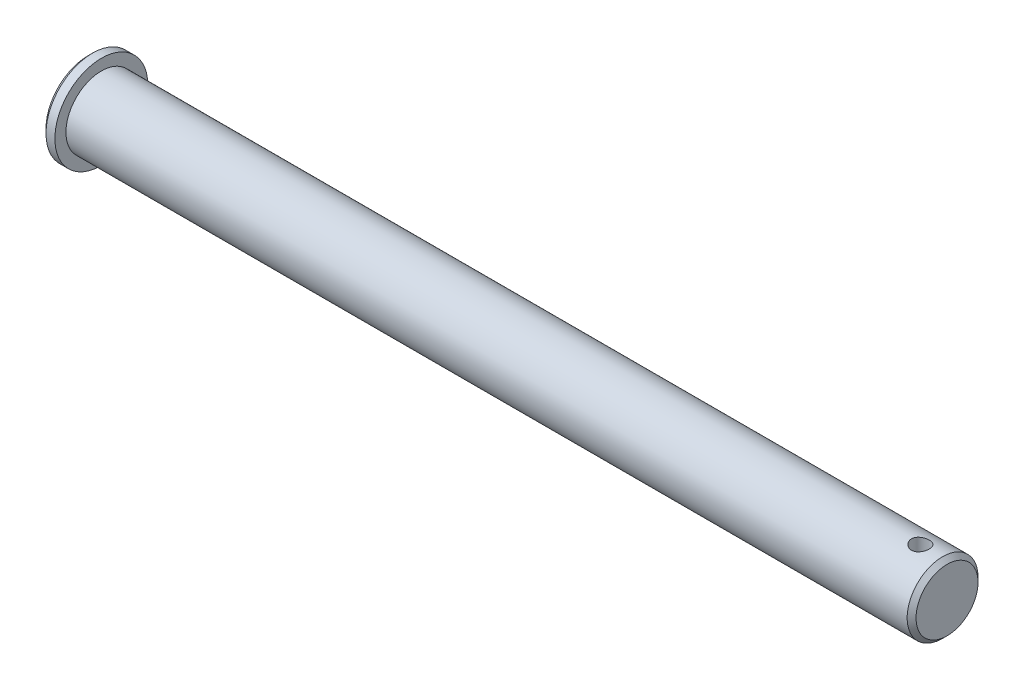
ISO-10303-21;
HEADER;
FILE_DESCRIPTION(('STEP AP214'),'2;1');
FILE_NAME('part.step','',(''),(''),'','','');
FILE_SCHEMA(('AUTOMOTIVE_DESIGN { 1 0 10303 214 1 1 1 1 }'));
ENDSEC;
DATA;
#1=APPLICATION_CONTEXT('core data for automotive mechanical design processes');
#2=APPLICATION_PROTOCOL_DEFINITION('international standard','automotive_design',2000,#1);
#3=PRODUCT_CONTEXT('',#1,'mechanical');
#4=PRODUCT('Part','Part','',(#3));
#5=PRODUCT_RELATED_PRODUCT_CATEGORY('part','',(#4));
#6=PRODUCT_DEFINITION_FORMATION('','',#4);
#7=PRODUCT_DEFINITION_CONTEXT('part definition',#1,'design');
#8=PRODUCT_DEFINITION('design','',#6,#7);
#9=PRODUCT_DEFINITION_SHAPE('','',#8);
#10=(LENGTH_UNIT() NAMED_UNIT(*) SI_UNIT(.MILLI.,.METRE.));
#11=(NAMED_UNIT(*) PLANE_ANGLE_UNIT() SI_UNIT($,.RADIAN.));
#12=(NAMED_UNIT(*) SI_UNIT($,.STERADIAN.) SOLID_ANGLE_UNIT());
#13=UNCERTAINTY_MEASURE_WITH_UNIT(LENGTH_MEASURE(1.E-05),#10,'distance_accuracy_value','');
#14=(GEOMETRIC_REPRESENTATION_CONTEXT(3) GLOBAL_UNCERTAINTY_ASSIGNED_CONTEXT((#13)) GLOBAL_UNIT_ASSIGNED_CONTEXT((#10,
#11,#12)) REPRESENTATION_CONTEXT('',''));
#15=CARTESIAN_POINT('',(0.,0.,0.));
#16=DIRECTION('',(0.,0.,1.));
#17=DIRECTION('',(1.,0.,0.));
#18=AXIS2_PLACEMENT_3D('',#15,#16,#17);
#19=CARTESIAN_POINT('',(0.,0.,0.));
#20=DIRECTION('',(-1.,0.,0.));
#21=DIRECTION('',(0.,0.,1.));
#22=AXIS2_PLACEMENT_3D('',#19,#20,#21);
#23=PLANE('',#22);
#24=CARTESIAN_POINT('',(0.,0.,0.));
#25=DIRECTION('',(-1.,0.,0.));
#26=DIRECTION('',(0.,0.,1.));
#27=AXIS2_PLACEMENT_3D('',#24,#25,#26);
#28=CIRCLE('',#27,9.49999999999998);
#29=CARTESIAN_POINT('',(0.,0.,9.49999999999998));
#30=VERTEX_POINT('',#29);
#31=EDGE_CURVE('E10',#30,#30,#28,.T.);
#32=ORIENTED_EDGE('',*,*,#31,.T.);
#33=EDGE_LOOP('',(#32));
#34=FACE_BOUND('',#33,.T.);
#35=ADVANCED_FACE('F39',(#34),#23,.T.);
#36=CARTESIAN_POINT('',(194.,0.,0.));
#37=DIRECTION('',(1.,0.,0.));
#38=DIRECTION('',(0.,0.,-1.));
#39=AXIS2_PLACEMENT_3D('',#36,#37,#38);
#40=CYLINDRICAL_SURFACE('',#39,10.5);
#41=CARTESIAN_POINT('',(1.,0.,0.));
#42=DIRECTION('',(-1.,0.,0.));
#43=DIRECTION('',(0.,0.,1.));
#44=AXIS2_PLACEMENT_3D('',#41,#42,#43);
#45=CIRCLE('',#44,10.5);
#46=CARTESIAN_POINT('',(1.,0.,10.5));
#47=VERTEX_POINT('',#46);
#48=EDGE_CURVE('E48',#47,#47,#45,.F.);
#49=ORIENTED_EDGE('',*,*,#48,.T.);
#50=EDGE_LOOP('',(#49));
#51=FACE_BOUND('',#50,.T.);
#52=CARTESIAN_POINT('',(3.,0.,0.));
#53=DIRECTION('',(1.,0.,0.));
#54=DIRECTION('',(0.,0.,-1.));
#55=AXIS2_PLACEMENT_3D('',#52,#53,#54);
#56=CIRCLE('',#55,10.5);
#57=CARTESIAN_POINT('',(3.,0.,-10.5));
#58=VERTEX_POINT('',#57);
#59=EDGE_CURVE('E64',#58,#58,#56,.T.);
#60=ORIENTED_EDGE('',*,*,#59,.F.);
#61=EDGE_LOOP('',(#60));
#62=FACE_BOUND('',#61,.T.);
#63=ADVANCED_FACE('F99',(#51,#62),#40,.T.);
#64=CARTESIAN_POINT('',(3.,10.5,0.));
#65=DIRECTION('',(1.,0.,0.));
#66=DIRECTION('',(0.,0.,-1.));
#67=AXIS2_PLACEMENT_3D('',#64,#65,#66);
#68=PLANE('',#67);
#69=ORIENTED_EDGE('',*,*,#59,.T.);
#70=EDGE_LOOP('',(#69));
#71=FACE_BOUND('',#70,.T.);
#72=CARTESIAN_POINT('',(3.,0.,0.));
#73=DIRECTION('',(1.,0.,0.));
#74=DIRECTION('',(0.,0.,-1.));
#75=AXIS2_PLACEMENT_3D('',#72,#73,#74);
#76=CIRCLE('',#75,8.);
#77=CARTESIAN_POINT('',(3.,0.,-8.));
#78=VERTEX_POINT('',#77);
#79=EDGE_CURVE('E74',#78,#78,#76,.T.);
#80=ORIENTED_EDGE('',*,*,#79,.F.);
#81=EDGE_LOOP('',(#80));
#82=FACE_BOUND('',#81,.T.);
#83=ADVANCED_FACE('F96',(#71,#82),#68,.T.);
#84=CARTESIAN_POINT('',(194.,0.,0.));
#85=DIRECTION('',(1.,0.,0.));
#86=DIRECTION('',(0.,0.,-1.));
#87=AXIS2_PLACEMENT_3D('',#84,#85,#86);
#88=CYLINDRICAL_SURFACE('',#87,8.);
#89=CARTESIAN_POINT('',(193.,0.,0.));
#90=DIRECTION('',(1.,0.,0.));
#91=DIRECTION('',(0.,0.,-1.));
#92=AXIS2_PLACEMENT_3D('',#89,#90,#91);
#93=CIRCLE('',#92,8.);
#94=CARTESIAN_POINT('',(193.,0.,-8.));
#95=VERTEX_POINT('',#94);
#96=EDGE_CURVE('E53',#95,#95,#93,.F.);
#97=ORIENTED_EDGE('',*,*,#96,.T.);
#98=EDGE_LOOP('',(#97));
#99=FACE_BOUND('',#98,.T.);
#100=CARTESIAN_POINT('',(188.,-7.74596669241484,2.));
#101=CARTESIAN_POINT('',(187.889559399259,-7.74596880070288,1.99999686287445));
#102=CARTESIAN_POINT('',(187.779084081057,-7.74835444811678,1.99082099639812));
#103=CARTESIAN_POINT('',(187.561305937461,-7.75761489594051,1.95441850037103));
#104=CARTESIAN_POINT('',(187.454004996425,-7.76449230897304,1.92718136539368));
#105=CARTESIAN_POINT('',(187.24575716945,-7.7819097967692,1.85559295970562));
#106=CARTESIAN_POINT('',(187.144802275691,-7.79244514152367,1.81126378228358));
#107=CARTESIAN_POINT('',(186.951751317968,-7.81598553623007,1.70681691300909));
#108=CARTESIAN_POINT('',(186.859655630336,-7.82899069102792,1.64669855084853));
#109=CARTESIAN_POINT('',(186.68491068379,-7.856325730845,1.51096674184949));
#110=CARTESIAN_POINT('',(186.60248511972,-7.87067678098428,1.43506951016323));
#111=CARTESIAN_POINT('',(186.451390884512,-7.89890300412235,1.27054565128053));
#112=CARTESIAN_POINT('',(186.382723499503,-7.91277813253111,1.18191783534425));
#113=CARTESIAN_POINT('',(186.260179625895,-7.93872332416466,0.992916160863166));
#114=CARTESIAN_POINT('',(186.206522889471,-7.95076549920474,0.892395660956097));
#115=CARTESIAN_POINT('',(186.116952284678,-7.97144649540787,0.683410547434204));
#116=CARTESIAN_POINT('',(186.081035798468,-7.98008581867476,0.57494710863354));
#117=CARTESIAN_POINT('',(186.028681732337,-7.99283807078544,0.355487007003313));
#118=CARTESIAN_POINT('',(186.011864284539,-7.99703915075451,0.244586175639166));
#119=CARTESIAN_POINT('',(185.99699329658,-8.00074875285838,0.0214630554102057));
#120=CARTESIAN_POINT('',(185.998936982232,-8.00025796877363,-0.0907590356304624));
#121=CARTESIAN_POINT('',(186.0212598802,-7.99470475962828,-0.310704494344781));
#122=CARTESIAN_POINT('',(186.041229060043,-7.98974401872699,-0.418472431202141));
#123=CARTESIAN_POINT('',(186.098377016039,-7.97592669219883,-0.629076494827379));
#124=CARTESIAN_POINT('',(186.135556708302,-7.96706989918753,-0.731912358740882));
#125=CARTESIAN_POINT('',(186.22640205655,-7.94630007760716,-0.930813407003617));
#126=CARTESIAN_POINT('',(186.280213635729,-7.93436015756043,-1.02680901953301));
#127=CARTESIAN_POINT('',(186.402684543293,-7.90871923047719,-1.20855124468098));
#128=CARTESIAN_POINT('',(186.471346454849,-7.89501791721992,-1.29429607017101));
#129=CARTESIAN_POINT('',(186.623766993586,-7.86690971015616,-1.45554807016992));
#130=CARTESIAN_POINT('',(186.707883913878,-7.85249375620734,-1.53071535815041));
#131=CARTESIAN_POINT('',(186.887679978832,-7.82492034813365,-1.66595275192605));
#132=CARTESIAN_POINT('',(186.983359663593,-7.81176295284776,-1.72602215209204));
#133=CARTESIAN_POINT('',(187.184232027319,-7.78816397465319,-1.8295762580452));
#134=CARTESIAN_POINT('',(187.289468584251,-7.77773586980576,-1.87297913394099));
#135=CARTESIAN_POINT('',(187.506068374461,-7.76094912111965,-1.94137124127269));
#136=CARTESIAN_POINT('',(187.617430291187,-7.75458960648175,-1.96636441310582));
#137=CARTESIAN_POINT('',(187.839967601219,-7.74684284831313,-1.99666371093214));
#138=CARTESIAN_POINT('',(187.951070234664,-7.74532871274919,-2.0024723791357));
#139=CARTESIAN_POINT('',(188.172657549263,-7.74709874784832,-1.99561359241243));
#140=CARTESIAN_POINT('',(188.283142286361,-7.75038247681013,-1.98294783827903));
#141=CARTESIAN_POINT('',(188.498491411964,-7.76125665563649,-1.93994037115012));
#142=CARTESIAN_POINT('',(188.603418181257,-7.768775761875,-1.90989125462539));
#143=CARTESIAN_POINT('',(188.806745166281,-7.7872057461677,-1.83329446533649));
#144=CARTESIAN_POINT('',(188.905144607244,-7.79811702598891,-1.78674483817003));
#145=CARTESIAN_POINT('',(189.094753022294,-7.8223690967461,-1.67741653434924));
#146=CARTESIAN_POINT('',(189.185783072034,-7.83575334885313,-1.6143374030685));
#147=CARTESIAN_POINT('',(189.356150690241,-7.86333666457373,-1.47412058586891));
#148=CARTESIAN_POINT('',(189.43548633332,-7.87753586182776,-1.39698058961088));
#149=CARTESIAN_POINT('',(189.582248834057,-7.90557922425285,-1.22852544196945));
#150=CARTESIAN_POINT('',(189.649328050039,-7.91940561649468,-1.13690390506318));
#151=CARTESIAN_POINT('',(189.767148693561,-7.94477773290988,-0.943405365389345));
#152=CARTESIAN_POINT('',(189.817890973287,-7.95632357603169,-0.84152889791518));
#153=CARTESIAN_POINT('',(189.901156827622,-7.9757609259065,-0.631116403462181));
#154=CARTESIAN_POINT('',(189.933811427503,-7.98367864017925,-0.522634762055761));
#155=CARTESIAN_POINT('',(189.980368267687,-7.99508234716634,-0.301499520637607));
#156=CARTESIAN_POINT('',(189.994274126991,-7.99856919514738,-0.188846730082473));
#157=CARTESIAN_POINT('',(190.002735179151,-8.00068338817612,0.0341670528866546));
#158=CARTESIAN_POINT('',(189.997803418191,-7.99943957759977,0.144507653932052));
#159=CARTESIAN_POINT('',(189.969904345411,-7.99251792914887,0.36273499282951));
#160=CARTESIAN_POINT('',(189.946937569974,-7.98684022314338,0.470621803561865));
#161=CARTESIAN_POINT('',(189.883895560458,-7.97170865707778,0.680342071289556));
#162=CARTESIAN_POINT('',(189.843913093371,-7.96227529004785,0.782204989161734));
#163=CARTESIAN_POINT('',(189.748058841961,-7.94062577827316,0.977834106083256));
#164=CARTESIAN_POINT('',(189.692185054659,-7.92840928277515,1.07159928253127));
#165=CARTESIAN_POINT('',(189.564569532008,-7.90214499360574,1.25080385684661));
#166=CARTESIAN_POINT('',(189.492479714192,-7.88806033883329,1.33598997659667));
#167=CARTESIAN_POINT('',(189.335154296045,-7.85981298114379,1.49323004054701));
#168=CARTESIAN_POINT('',(189.249915367778,-7.84565025934605,1.56528065015318));
#169=CARTESIAN_POINT('',(189.066797171621,-7.81854951691005,1.69552405294366));
#170=CARTESIAN_POINT('',(188.968711753269,-7.80563927346578,1.75343323883276));
#171=CARTESIAN_POINT('',(188.76388902025,-7.78287910989656,1.85185379317094));
#172=CARTESIAN_POINT('',(188.657158067812,-7.77302696466428,1.8923778195043));
#173=CARTESIAN_POINT('',(188.45884597633,-7.75903817501475,1.948845057142));
#174=CARTESIAN_POINT('',(188.368213671228,-7.75417326006998,1.96798634119375));
#175=CARTESIAN_POINT('',(188.185062262005,-7.7476367716524,1.99356458514353));
#176=CARTESIAN_POINT('',(188.092543319511,-7.74596492578216,2.0000026287435));
#177=CARTESIAN_POINT('',(188.,-7.74596669241484,2.));
#178=B_SPLINE_CURVE_WITH_KNOTS('',3,(#100,#101,#102,#103,#104,#105,#106,#107,#108,#109,#110,
#111,#112,#113,#114,#115,#116,#117,#118,#119,#120,#121,#122,#123,#124,#125,#126,#127,#128,#129,
#130,#131,#132,#133,#134,#135,#136,#137,#138,#139,#140,#141,#142,#143,#144,#145,#146,#147,#148,
#149,#150,#151,#152,#153,#154,#155,#156,#157,#158,#159,#160,#161,#162,#163,#164,#165,#166,#167,
#168,#169,#170,#171,#172,#173,#174,#175,#176,#177),.UNSPECIFIED.,.T.,.F.,(4,2,2,2,2,2,2,2,2,2,2,
2,2,2,2,2,2,2,2,2,2,2,2,2,2,2,2,2,2,2,2,2,2,2,2,2,2,2,4),(0.,0.330981953388902,
0.662156593142942,0.992904581732849,1.32366661404385,1.66099163354379,1.99834817183892,
2.34041197118334,2.68242527877675,3.01751000796277,3.35254518932816,3.68014610151157,
4.00776445379829,4.33834299403553,4.66897908375129,5.00856373257529,5.34816424959842,
5.68941145606725,6.03058560103639,6.36274859809374,6.69488101747042,7.02157924007366,
7.34831617137131,7.68146276687324,8.01466415108033,8.35620264772252,8.69772332575639,
9.03673658245541,9.37568439127228,9.70546756901963,10.0352409390158,10.3632390124777,
10.6912784459046,11.0271767726565,11.363160252524,11.7054118182895,12.0474137709605,
12.3247826174462,12.6021278008237),.UNSPECIFIED.);
#179=CARTESIAN_POINT('',(188.,-7.74596669241484,2.));
#180=VERTEX_POINT('',#179);
#181=EDGE_CURVE('E65',#180,#180,#178,.T.);
#182=ORIENTED_EDGE('',*,*,#181,.F.);
#183=EDGE_LOOP('',(#182));
#184=FACE_BOUND('',#183,.T.);
#185=CARTESIAN_POINT('',(188.,7.74596669241483,2.));
#186=CARTESIAN_POINT('',(188.110440600741,7.74596880070288,1.99999686287445));
#187=CARTESIAN_POINT('',(188.220915918943,7.74835444811678,1.99082099639812));
#188=CARTESIAN_POINT('',(188.438694062539,7.75761489594051,1.95441850037103));
#189=CARTESIAN_POINT('',(188.545995003575,7.76449230897304,1.92718136539368));
#190=CARTESIAN_POINT('',(188.75424283055,7.7819097967692,1.85559295970562));
#191=CARTESIAN_POINT('',(188.855197724309,7.79244514152366,1.81126378228358));
#192=CARTESIAN_POINT('',(189.048248682032,7.81598553623007,1.7068169130091));
#193=CARTESIAN_POINT('',(189.140344369664,7.82899069102792,1.64669855084854));
#194=CARTESIAN_POINT('',(189.31508931621,7.856325730845,1.51096674184949));
#195=CARTESIAN_POINT('',(189.39751488028,7.87067678098428,1.43506951016323));
#196=CARTESIAN_POINT('',(189.548609115488,7.89890300412235,1.27054565128053));
#197=CARTESIAN_POINT('',(189.617276500497,7.91277813253111,1.18191783534424));
#198=CARTESIAN_POINT('',(189.739820374105,7.93872332416466,0.992916160863163));
#199=CARTESIAN_POINT('',(189.793477110529,7.95076549920474,0.892395660956094));
#200=CARTESIAN_POINT('',(189.883047715322,7.97144649540787,0.6834105474342));
#201=CARTESIAN_POINT('',(189.918964201532,7.98008581867476,0.574947108633536));
#202=CARTESIAN_POINT('',(189.971318267663,7.99283807078544,0.355487007003311));
#203=CARTESIAN_POINT('',(189.988135715461,7.99703915075451,0.244586175639166));
#204=CARTESIAN_POINT('',(190.00300670342,8.00074875285838,0.0214630554102064));
#205=CARTESIAN_POINT('',(190.001063017768,8.00025796877363,-0.0907590356304621));
#206=CARTESIAN_POINT('',(189.9787401198,7.99470475962828,-0.310704494344781));
#207=CARTESIAN_POINT('',(189.958770939957,7.98974401872699,-0.418472431202141));
#208=CARTESIAN_POINT('',(189.901622983961,7.97592669219883,-0.629076494827379));
#209=CARTESIAN_POINT('',(189.864443291698,7.96706989918753,-0.731912358740883));
#210=CARTESIAN_POINT('',(189.77359794345,7.94630007760716,-0.930813407003617));
#211=CARTESIAN_POINT('',(189.719786364271,7.93436015756043,-1.02680901953301));
#212=CARTESIAN_POINT('',(189.597315456707,7.90871923047719,-1.20855124468098));
#213=CARTESIAN_POINT('',(189.528653545151,7.89501791721992,-1.29429607017101));
#214=CARTESIAN_POINT('',(189.376233006414,7.86690971015616,-1.45554807016992));
#215=CARTESIAN_POINT('',(189.292116086122,7.85249375620734,-1.53071535815041));
#216=CARTESIAN_POINT('',(189.112320021168,7.82492034813365,-1.66595275192605));
#217=CARTESIAN_POINT('',(189.016640336407,7.81176295284776,-1.72602215209204));
#218=CARTESIAN_POINT('',(188.815767972681,7.78816397465319,-1.8295762580452));
#219=CARTESIAN_POINT('',(188.710531415749,7.77773586980577,-1.87297913394098));
#220=CARTESIAN_POINT('',(188.493931625539,7.76094912111965,-1.94137124127268));
#221=CARTESIAN_POINT('',(188.382569708813,7.75458960648175,-1.96636441310582));
#222=CARTESIAN_POINT('',(188.160032398781,7.74684284831313,-1.99666371093214));
#223=CARTESIAN_POINT('',(188.048929765336,7.74532871274919,-2.0024723791357));
#224=CARTESIAN_POINT('',(187.827342450737,7.74709874784832,-1.99561359241243));
#225=CARTESIAN_POINT('',(187.716857713639,7.75038247681013,-1.98294783827903));
#226=CARTESIAN_POINT('',(187.501508588036,7.76125665563649,-1.93994037115012));
#227=CARTESIAN_POINT('',(187.396581818743,7.768775761875,-1.90989125462539));
#228=CARTESIAN_POINT('',(187.193254833719,7.7872057461677,-1.83329446533649));
#229=CARTESIAN_POINT('',(187.094855392756,7.79811702598891,-1.78674483817003));
#230=CARTESIAN_POINT('',(186.905246977706,7.8223690967461,-1.67741653434924));
#231=CARTESIAN_POINT('',(186.814216927966,7.83575334885313,-1.6143374030685));
#232=CARTESIAN_POINT('',(186.643849309759,7.86333666457373,-1.47412058586891));
#233=CARTESIAN_POINT('',(186.56451366668,7.87753586182776,-1.39698058961088));
#234=CARTESIAN_POINT('',(186.417751165943,7.90557922425285,-1.22852544196945));
#235=CARTESIAN_POINT('',(186.350671949961,7.91940561649468,-1.13690390506319));
#236=CARTESIAN_POINT('',(186.232851306439,7.94477773290988,-0.943405365389355));
#237=CARTESIAN_POINT('',(186.182109026713,7.95632357603169,-0.841528897915185));
#238=CARTESIAN_POINT('',(186.098843172378,7.9757609259065,-0.63111640346218));
#239=CARTESIAN_POINT('',(186.066188572497,7.98367864017925,-0.522634762055761));
#240=CARTESIAN_POINT('',(186.019631732313,7.99508234716634,-0.301499520637607));
#241=CARTESIAN_POINT('',(186.005725873009,7.99856919514738,-0.188846730082474));
#242=CARTESIAN_POINT('',(185.997264820849,8.00068338817612,0.0341670528866544));
#243=CARTESIAN_POINT('',(186.002196581809,7.99943957759977,0.144507653932052));
#244=CARTESIAN_POINT('',(186.030095654589,7.99251792914887,0.36273499282951));
#245=CARTESIAN_POINT('',(186.053062430026,7.98684022314338,0.470621803561866));
#246=CARTESIAN_POINT('',(186.116104439542,7.97170865707778,0.680342071289556));
#247=CARTESIAN_POINT('',(186.156086906629,7.96227529004785,0.782204989161734));
#248=CARTESIAN_POINT('',(186.251941158039,7.94062577827316,0.977834106083256));
#249=CARTESIAN_POINT('',(186.307814945341,7.92840928277515,1.07159928253127));
#250=CARTESIAN_POINT('',(186.435430467992,7.90214499360574,1.25080385684661));
#251=CARTESIAN_POINT('',(186.507520285808,7.88806033883329,1.33598997659667));
#252=CARTESIAN_POINT('',(186.664845703955,7.85981298114379,1.49323004054701));
#253=CARTESIAN_POINT('',(186.750084632222,7.84565025934604,1.56528065015318));
#254=CARTESIAN_POINT('',(186.933202828379,7.81854951691005,1.69552405294366));
#255=CARTESIAN_POINT('',(187.031288246731,7.80563927346578,1.75343323883275));
#256=CARTESIAN_POINT('',(187.23611097975,7.78287910989656,1.85185379317093));
#257=CARTESIAN_POINT('',(187.342841932188,7.77302696466428,1.8923778195043));
#258=CARTESIAN_POINT('',(187.54115402367,7.75903817501475,1.948845057142));
#259=CARTESIAN_POINT('',(187.631786328772,7.75417326006998,1.96798634119375));
#260=CARTESIAN_POINT('',(187.814937737995,7.7476367716524,1.99356458514353));
#261=CARTESIAN_POINT('',(187.907456680489,7.74596492578215,2.0000026287435));
#262=CARTESIAN_POINT('',(188.,7.74596669241483,2.));
#263=B_SPLINE_CURVE_WITH_KNOTS('',3,(#185,#186,#187,#188,#189,#190,#191,#192,#193,#194,#195,
#196,#197,#198,#199,#200,#201,#202,#203,#204,#205,#206,#207,#208,#209,#210,#211,#212,#213,#214,
#215,#216,#217,#218,#219,#220,#221,#222,#223,#224,#225,#226,#227,#228,#229,#230,#231,#232,#233,
#234,#235,#236,#237,#238,#239,#240,#241,#242,#243,#244,#245,#246,#247,#248,#249,#250,#251,#252,
#253,#254,#255,#256,#257,#258,#259,#260,#261,#262),.UNSPECIFIED.,.T.,.F.,(4,2,2,2,2,2,2,2,2,2,2,
2,2,2,2,2,2,2,2,2,2,2,2,2,2,2,2,2,2,2,2,2,2,2,2,2,2,2,4),(0.,0.330981953388903,
0.662156593142942,0.992904581732819,1.32366661404385,1.66099163354379,1.99834817183892,
2.34041197118337,2.68242527877675,3.01751000796277,3.35254518932816,3.68014610151158,
4.00776445379829,4.33834299403554,4.66897908375129,5.0085637325753,5.34816424959842,
5.68941145606722,6.0305856010364,6.36274859809374,6.69488101747042,7.02157924007363,
7.34831617137131,7.68146276687324,8.01466415108034,8.35620264772252,8.6977233257564,
9.03673658245541,9.37568439127229,9.70546756901964,10.0352409390158,10.3632390124777,
10.6912784459046,11.0271767726565,11.3631602525241,11.7054118182895,12.0474137709605,
12.3247826174462,12.6021278008237),.UNSPECIFIED.);
#264=CARTESIAN_POINT('',(188.,7.74596669241483,2.));
#265=VERTEX_POINT('',#264);
#266=EDGE_CURVE('E75',#265,#265,#263,.T.);
#267=ORIENTED_EDGE('',*,*,#266,.F.);
#268=EDGE_LOOP('',(#267));
#269=FACE_BOUND('',#268,.T.);
#270=ORIENTED_EDGE('',*,*,#79,.T.);
#271=EDGE_LOOP('',(#270));
#272=FACE_BOUND('',#271,.T.);
#273=ADVANCED_FACE('F80',(#99,#184,#269,#272),#88,.T.);
#274=CARTESIAN_POINT('',(194.,8.,0.));
#275=DIRECTION('',(1.,0.,0.));
#276=DIRECTION('',(0.,0.,-1.));
#277=AXIS2_PLACEMENT_3D('',#274,#275,#276);
#278=PLANE('',#277);
#279=CARTESIAN_POINT('',(194.,0.,0.));
#280=DIRECTION('',(1.,0.,0.));
#281=DIRECTION('',(0.,0.,-1.));
#282=AXIS2_PLACEMENT_3D('',#279,#280,#281);
#283=CIRCLE('',#282,7.00000000000001);
#284=CARTESIAN_POINT('',(194.,0.,-7.00000000000001));
#285=VERTEX_POINT('',#284);
#286=EDGE_CURVE('E58',#285,#285,#283,.T.);
#287=ORIENTED_EDGE('',*,*,#286,.T.);
#288=EDGE_LOOP('',(#287));
#289=FACE_BOUND('',#288,.T.);
#290=ADVANCED_FACE('F88',(#289),#278,.T.);
#291=CARTESIAN_POINT('',(188.,-10.5,0.));
#292=DIRECTION('',(0.,1.,0.));
#293=DIRECTION('',(0.,0.,1.));
#294=AXIS2_PLACEMENT_3D('',#291,#292,#293);
#295=CYLINDRICAL_SURFACE('',#294,2.);
#296=ORIENTED_EDGE('',*,*,#181,.T.);
#297=EDGE_LOOP('',(#296));
#298=FACE_BOUND('',#297,.T.);
#299=ORIENTED_EDGE('',*,*,#266,.T.);
#300=EDGE_LOOP('',(#299));
#301=FACE_BOUND('',#300,.T.);
#302=ADVANCED_FACE('F84',(#298,#301),#295,.F.);
#303=CARTESIAN_POINT('',(194.,0.,0.));
#304=DIRECTION('',(-1.,0.,0.));
#305=DIRECTION('',(0.,0.,1.));
#306=AXIS2_PLACEMENT_3D('',#303,#304,#305);
#307=CONICAL_SURFACE('',#306,7.00000000000001,0.785398163397445);
#308=ORIENTED_EDGE('',*,*,#96,.F.);
#309=EDGE_LOOP('',(#308));
#310=FACE_BOUND('',#309,.T.);
#311=ORIENTED_EDGE('',*,*,#286,.F.);
#312=EDGE_LOOP('',(#311));
#313=FACE_BOUND('',#312,.T.);
#314=ADVANCED_FACE('F87',(#310,#313),#307,.T.);
#315=CARTESIAN_POINT('',(1.,0.,0.));
#316=DIRECTION('',(1.,0.,0.));
#317=DIRECTION('',(0.,0.,-1.));
#318=AXIS2_PLACEMENT_3D('',#315,#316,#317);
#319=CONICAL_SURFACE('',#318,10.5,0.785398163397458);
#320=ORIENTED_EDGE('',*,*,#31,.F.);
#321=EDGE_LOOP('',(#320));
#322=FACE_BOUND('',#321,.T.);
#323=ORIENTED_EDGE('',*,*,#48,.F.);
#324=EDGE_LOOP('',(#323));
#325=FACE_BOUND('',#324,.T.);
#326=ADVANCED_FACE('F42',(#322,#325),#319,.T.);
#327=CLOSED_SHELL('',(#35,#63,#83,#273,#290,#302,#314,#326));
#328=MANIFOLD_SOLID_BREP('B2',#327);
#329=ADVANCED_BREP_SHAPE_REPRESENTATION('',(#18,#328),#14);
#330=SHAPE_DEFINITION_REPRESENTATION(#9,#329);
ENDSEC;
END-ISO-10303-21;
